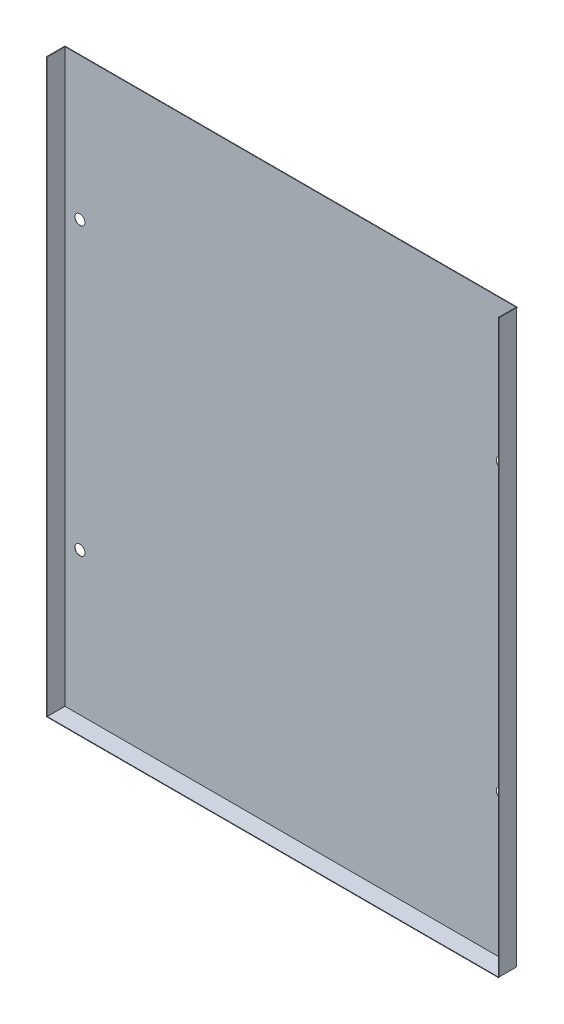
ISO-10303-21;
HEADER;
FILE_DESCRIPTION(('STEP AP214'),'2;1');
FILE_NAME('part.step','',(''),(''),'','','');
FILE_SCHEMA(('AUTOMOTIVE_DESIGN { 1 0 10303 214 1 1 1 1 }'));
ENDSEC;
DATA;
#1=APPLICATION_CONTEXT('core data for automotive mechanical design processes');
#2=APPLICATION_PROTOCOL_DEFINITION('international standard','automotive_design',2000,#1);
#3=PRODUCT_CONTEXT('',#1,'mechanical');
#4=PRODUCT('Part','Part','',(#3));
#5=PRODUCT_RELATED_PRODUCT_CATEGORY('part','',(#4));
#6=PRODUCT_DEFINITION_FORMATION('','',#4);
#7=PRODUCT_DEFINITION_CONTEXT('part definition',#1,'design');
#8=PRODUCT_DEFINITION('design','',#6,#7);
#9=PRODUCT_DEFINITION_SHAPE('','',#8);
#10=(LENGTH_UNIT() NAMED_UNIT(*) SI_UNIT(.MILLI.,.METRE.));
#11=(NAMED_UNIT(*) PLANE_ANGLE_UNIT() SI_UNIT($,.RADIAN.));
#12=(NAMED_UNIT(*) SI_UNIT($,.STERADIAN.) SOLID_ANGLE_UNIT());
#13=UNCERTAINTY_MEASURE_WITH_UNIT(LENGTH_MEASURE(1.E-05),#10,'distance_accuracy_value','');
#14=(GEOMETRIC_REPRESENTATION_CONTEXT(3) GLOBAL_UNCERTAINTY_ASSIGNED_CONTEXT((#13)) GLOBAL_UNIT_ASSIGNED_CONTEXT((#10,
#11,#12)) REPRESENTATION_CONTEXT('',''));
#15=CARTESIAN_POINT('',(0.,0.,0.));
#16=DIRECTION('',(0.,0.,1.));
#17=DIRECTION('',(1.,0.,0.));
#18=AXIS2_PLACEMENT_3D('',#15,#16,#17);
#19=CARTESIAN_POINT('',(-83.71996294,56.94427919,0.0686));
#20=DIRECTION('',(0.,0.,-1.));
#21=DIRECTION('',(-1.,0.,0.));
#22=AXIS2_PLACEMENT_3D('',#19,#20,#21);
#23=CYLINDRICAL_SURFACE('',#22,2.);
#24=CARTESIAN_POINT('',(-83.71996294,56.94427919,0.0686));
#25=DIRECTION('',(0.,0.,1.));
#26=DIRECTION('',(1.,0.,0.));
#27=AXIS2_PLACEMENT_3D('',#24,#25,#26);
#28=CIRCLE('',#27,2.);
#29=CARTESIAN_POINT('',(-81.71996294,56.94427919,0.0686));
#30=VERTEX_POINT('',#29);
#31=EDGE_CURVE('E361',#30,#30,#28,.T.);
#32=ORIENTED_EDGE('',*,*,#31,.T.);
#33=EDGE_LOOP('',(#32));
#34=FACE_BOUND('',#33,.T.);
#35=CARTESIAN_POINT('',(-83.71996294,56.94427919,0.));
#36=DIRECTION('',(0.,0.,1.));
#37=DIRECTION('',(1.,0.,0.));
#38=AXIS2_PLACEMENT_3D('',#35,#36,#37);
#39=CIRCLE('',#38,2.);
#40=CARTESIAN_POINT('',(-81.71996294,56.94427919,0.));
#41=VERTEX_POINT('',#40);
#42=EDGE_CURVE('E366',#41,#41,#39,.T.);
#43=ORIENTED_EDGE('',*,*,#42,.F.);
#44=EDGE_LOOP('',(#43));
#45=FACE_BOUND('',#44,.T.);
#46=ADVANCED_FACE('F37',(#34,#45),#23,.F.);
#47=CARTESIAN_POINT('',(-83.71996294,-56.7081132,0.0686));
#48=DIRECTION('',(0.,0.,-1.));
#49=DIRECTION('',(-1.,0.,0.));
#50=AXIS2_PLACEMENT_3D('',#47,#48,#49);
#51=CYLINDRICAL_SURFACE('',#50,2.);
#52=CARTESIAN_POINT('',(-83.71996294,-56.7081132,0.0686));
#53=DIRECTION('',(0.,0.,1.));
#54=DIRECTION('',(1.,0.,0.));
#55=AXIS2_PLACEMENT_3D('',#52,#53,#54);
#56=CIRCLE('',#55,2.);
#57=CARTESIAN_POINT('',(-81.71996294,-56.7081132,0.0686));
#58=VERTEX_POINT('',#57);
#59=EDGE_CURVE('E358',#58,#58,#56,.T.);
#60=ORIENTED_EDGE('',*,*,#59,.T.);
#61=EDGE_LOOP('',(#60));
#62=FACE_BOUND('',#61,.T.);
#63=CARTESIAN_POINT('',(-83.71996294,-56.7081132,0.));
#64=DIRECTION('',(0.,0.,1.));
#65=DIRECTION('',(1.,0.,0.));
#66=AXIS2_PLACEMENT_3D('',#63,#64,#65);
#67=CIRCLE('',#66,2.);
#68=CARTESIAN_POINT('',(-81.71996294,-56.7081132,0.));
#69=VERTEX_POINT('',#68);
#70=EDGE_CURVE('E264',#69,#69,#67,.T.);
#71=ORIENTED_EDGE('',*,*,#70,.F.);
#72=EDGE_LOOP('',(#71));
#73=FACE_BOUND('',#72,.T.);
#74=ADVANCED_FACE('F39',(#62,#73),#51,.F.);
#75=CARTESIAN_POINT('',(0.,0.,0.0686));
#76=DIRECTION('',(0.,0.,1.));
#77=DIRECTION('',(1.,0.,0.));
#78=AXIS2_PLACEMENT_3D('',#75,#76,#77);
#79=PLANE('',#78);
#80=ORIENTED_EDGE('',*,*,#59,.F.);
#81=EDGE_LOOP('',(#80));
#82=FACE_BOUND('',#81,.T.);
#83=ORIENTED_EDGE('',*,*,#31,.F.);
#84=EDGE_LOOP('',(#83));
#85=FACE_BOUND('',#84,.T.);
#86=DIRECTION('',(0.,1.,0.));
#87=VECTOR('',#86,1.);
#88=CARTESIAN_POINT('',(89.6514,0.,0.0686));
#89=LINE('',#88,#87);
#90=CARTESIAN_POINT('',(89.6514,-113.4657,0.0686000000000003));
#91=VERTEX_POINT('',#90);
#92=CARTESIAN_POINT('',(89.6514,113.5343,0.068600000000002));
#93=VERTEX_POINT('',#92);
#94=EDGE_CURVE('E123',#91,#93,#89,.T.);
#95=ORIENTED_EDGE('',*,*,#94,.T.);
#96=DIRECTION('',(1.,0.,0.));
#97=VECTOR('',#96,1.);
#98=CARTESIAN_POINT('',(-89.6514,113.5343,0.068600000000002));
#99=LINE('',#98,#97);
#100=CARTESIAN_POINT('',(-89.6514,113.5343,0.068600000000002));
#101=VERTEX_POINT('',#100);
#102=EDGE_CURVE('E269',#101,#93,#99,.T.);
#103=ORIENTED_EDGE('',*,*,#102,.F.);
#104=DIRECTION('',(0.,1.,0.));
#105=VECTOR('',#104,1.);
#106=CARTESIAN_POINT('',(-89.6514,0.,0.0686));
#107=LINE('',#106,#105);
#108=CARTESIAN_POINT('',(-89.6514,-113.4657,0.0686000000000003));
#109=VERTEX_POINT('',#108);
#110=EDGE_CURVE('E46',#109,#101,#107,.T.);
#111=ORIENTED_EDGE('',*,*,#110,.F.);
#112=DIRECTION('',(1.,0.,0.));
#113=VECTOR('',#112,1.);
#114=CARTESIAN_POINT('',(0.,-113.4657,0.0686));
#115=LINE('',#114,#113);
#116=EDGE_CURVE('E11',#109,#91,#115,.T.);
#117=ORIENTED_EDGE('',*,*,#116,.T.);
#118=EDGE_LOOP('',(#95,#103,#111,#117));
#119=FACE_BOUND('',#118,.T.);
#120=CARTESIAN_POINT('',(83.71996294,-56.7081132,0.0686));
#121=DIRECTION('',(0.,0.,-1.));
#122=DIRECTION('',(-1.,0.,0.));
#123=AXIS2_PLACEMENT_3D('',#120,#121,#122);
#124=CIRCLE('',#123,2.);
#125=CARTESIAN_POINT('',(81.71996294,-56.7081132,0.0686));
#126=VERTEX_POINT('',#125);
#127=EDGE_CURVE('E154',#126,#126,#124,.T.);
#128=ORIENTED_EDGE('',*,*,#127,.T.);
#129=EDGE_LOOP('',(#128));
#130=FACE_BOUND('',#129,.T.);
#131=CARTESIAN_POINT('',(83.71996294,56.94427919,0.0686));
#132=DIRECTION('',(0.,0.,-1.));
#133=DIRECTION('',(-1.,0.,0.));
#134=AXIS2_PLACEMENT_3D('',#131,#132,#133);
#135=CIRCLE('',#134,2.);
#136=CARTESIAN_POINT('',(81.71996294,56.94427919,0.0686));
#137=VERTEX_POINT('',#136);
#138=EDGE_CURVE('E128',#137,#137,#135,.T.);
#139=ORIENTED_EDGE('',*,*,#138,.T.);
#140=EDGE_LOOP('',(#139));
#141=FACE_BOUND('',#140,.T.);
#142=ADVANCED_FACE('F290',(#82,#85,#119,#130,#141),#79,.T.);
#143=CARTESIAN_POINT('',(0.,0.,0.));
#144=DIRECTION('',(0.,0.,1.));
#145=DIRECTION('',(1.,0.,0.));
#146=AXIS2_PLACEMENT_3D('',#143,#144,#145);
#147=PLANE('',#146);
#148=DIRECTION('',(0.,-1.,0.));
#149=VECTOR('',#148,1.);
#150=CARTESIAN_POINT('',(89.72,113.4657,0.));
#151=LINE('',#150,#149);
#152=CARTESIAN_POINT('',(89.72,113.4657,0.));
#153=VERTEX_POINT('',#152);
#154=CARTESIAN_POINT('',(89.72,-113.5343,0.));
#155=VERTEX_POINT('',#154);
#156=EDGE_CURVE('E170',#153,#155,#151,.T.);
#157=ORIENTED_EDGE('',*,*,#156,.T.);
#158=DIRECTION('',(1.,0.,0.));
#159=VECTOR('',#158,1.);
#160=CARTESIAN_POINT('',(-89.72,-113.5343,0.));
#161=LINE('',#160,#159);
#162=CARTESIAN_POINT('',(-89.72,-113.5343,0.));
#163=VERTEX_POINT('',#162);
#164=EDGE_CURVE('E349',#163,#155,#161,.T.);
#165=ORIENTED_EDGE('',*,*,#164,.F.);
#166=DIRECTION('',(0.,-1.,0.));
#167=VECTOR('',#166,1.);
#168=CARTESIAN_POINT('',(-89.72,113.4657,0.));
#169=LINE('',#168,#167);
#170=CARTESIAN_POINT('',(-89.72,113.4657,0.));
#171=VERTEX_POINT('',#170);
#172=EDGE_CURVE('E351',#171,#163,#169,.T.);
#173=ORIENTED_EDGE('',*,*,#172,.F.);
#174=DIRECTION('',(1.,0.,0.));
#175=VECTOR('',#174,1.);
#176=CARTESIAN_POINT('',(0.,113.4657,0.));
#177=LINE('',#176,#175);
#178=EDGE_CURVE('E73',#171,#153,#177,.T.);
#179=ORIENTED_EDGE('',*,*,#178,.T.);
#180=EDGE_LOOP('',(#157,#165,#173,#179));
#181=FACE_BOUND('',#180,.T.);
#182=ORIENTED_EDGE('',*,*,#70,.T.);
#183=EDGE_LOOP('',(#182));
#184=FACE_BOUND('',#183,.T.);
#185=ORIENTED_EDGE('',*,*,#42,.T.);
#186=EDGE_LOOP('',(#185));
#187=FACE_BOUND('',#186,.T.);
#188=CARTESIAN_POINT('',(83.71996294,-56.7081132,0.));
#189=DIRECTION('',(0.,0.,-1.));
#190=DIRECTION('',(-1.,0.,0.));
#191=AXIS2_PLACEMENT_3D('',#188,#189,#190);
#192=CIRCLE('',#191,2.);
#193=CARTESIAN_POINT('',(81.71996294,-56.7081132,0.));
#194=VERTEX_POINT('',#193);
#195=EDGE_CURVE('E155',#194,#194,#192,.T.);
#196=ORIENTED_EDGE('',*,*,#195,.F.);
#197=EDGE_LOOP('',(#196));
#198=FACE_BOUND('',#197,.T.);
#199=CARTESIAN_POINT('',(83.71996294,56.94427919,0.));
#200=DIRECTION('',(0.,0.,-1.));
#201=DIRECTION('',(-1.,0.,0.));
#202=AXIS2_PLACEMENT_3D('',#199,#200,#201);
#203=CIRCLE('',#202,2.);
#204=CARTESIAN_POINT('',(81.71996294,56.94427919,0.));
#205=VERTEX_POINT('',#204);
#206=EDGE_CURVE('E151',#205,#205,#203,.T.);
#207=ORIENTED_EDGE('',*,*,#206,.F.);
#208=EDGE_LOOP('',(#207));
#209=FACE_BOUND('',#208,.T.);
#210=ADVANCED_FACE('F295',(#181,#184,#187,#198,#209),#147,.F.);
#211=CARTESIAN_POINT('',(0.,-113.4657,7.0524));
#212=DIRECTION('',(0.,-1.,0.));
#213=DIRECTION('',(0.,0.,-1.));
#214=AXIS2_PLACEMENT_3D('',#211,#212,#213);
#215=PLANE('',#214);
#216=ORIENTED_EDGE('',*,*,#116,.F.);
#217=DIRECTION('',(0.,0.,-1.));
#218=VECTOR('',#217,1.);
#219=CARTESIAN_POINT('',(-89.6514,-113.4657,7.0524));
#220=LINE('',#219,#218);
#221=CARTESIAN_POINT('',(-89.6514,-113.4657,7.121));
#222=VERTEX_POINT('',#221);
#223=EDGE_CURVE('E259',#222,#109,#220,.T.);
#224=ORIENTED_EDGE('',*,*,#223,.F.);
#225=DIRECTION('',(-1.,0.,0.));
#226=VECTOR('',#225,1.);
#227=CARTESIAN_POINT('',(-89.6514,-113.4657,7.121));
#228=LINE('',#227,#226);
#229=CARTESIAN_POINT('',(89.6514,-113.4657,7.121));
#230=VERTEX_POINT('',#229);
#231=EDGE_CURVE('E137',#230,#222,#228,.T.);
#232=ORIENTED_EDGE('',*,*,#231,.F.);
#233=DIRECTION('',(0.,0.,-1.));
#234=VECTOR('',#233,1.);
#235=CARTESIAN_POINT('',(89.6514,-113.4657,7.0524));
#236=LINE('',#235,#234);
#237=EDGE_CURVE('E167',#230,#91,#236,.T.);
#238=ORIENTED_EDGE('',*,*,#237,.T.);
#239=EDGE_LOOP('',(#216,#224,#232,#238));
#240=FACE_BOUND('',#239,.T.);
#241=ADVANCED_FACE('F260',(#240),#215,.F.);
#242=CARTESIAN_POINT('',(-89.6514,-113.4657,7.0524));
#243=DIRECTION('',(-1.,0.,0.));
#244=DIRECTION('',(0.,0.,1.));
#245=AXIS2_PLACEMENT_3D('',#242,#243,#244);
#246=PLANE('',#245);
#247=ORIENTED_EDGE('',*,*,#110,.T.);
#248=DIRECTION('',(0.,0.,-1.));
#249=VECTOR('',#248,1.);
#250=CARTESIAN_POINT('',(-89.6514,113.5343,7.0524));
#251=LINE('',#250,#249);
#252=CARTESIAN_POINT('',(-89.6514,113.5343,7.121));
#253=VERTEX_POINT('',#252);
#254=EDGE_CURVE('E116',#253,#101,#251,.T.);
#255=ORIENTED_EDGE('',*,*,#254,.F.);
#256=DIRECTION('',(0.,1.,0.));
#257=VECTOR('',#256,1.);
#258=CARTESIAN_POINT('',(-89.6514,113.5343,7.121));
#259=LINE('',#258,#257);
#260=EDGE_CURVE('E125',#222,#253,#259,.T.);
#261=ORIENTED_EDGE('',*,*,#260,.F.);
#262=ORIENTED_EDGE('',*,*,#223,.T.);
#263=EDGE_LOOP('',(#247,#255,#261,#262));
#264=FACE_BOUND('',#263,.T.);
#265=ADVANCED_FACE('F266',(#264),#246,.F.);
#266=CARTESIAN_POINT('',(-89.72,113.4657,7.0524));
#267=DIRECTION('',(1.,0.,0.));
#268=DIRECTION('',(0.,0.,-1.));
#269=AXIS2_PLACEMENT_3D('',#266,#267,#268);
#270=PLANE('',#269);
#271=ORIENTED_EDGE('',*,*,#172,.T.);
#272=DIRECTION('',(0.,0.,-1.));
#273=VECTOR('',#272,1.);
#274=CARTESIAN_POINT('',(-89.72,-113.5343,7.0524));
#275=LINE('',#274,#273);
#276=CARTESIAN_POINT('',(-89.72,-113.5343,7.0524));
#277=VERTEX_POINT('',#276);
#278=EDGE_CURVE('E61',#277,#163,#275,.T.);
#279=ORIENTED_EDGE('',*,*,#278,.F.);
#280=DIRECTION('',(0.,-1.,0.));
#281=VECTOR('',#280,1.);
#282=CARTESIAN_POINT('',(-89.72,113.4657,7.0524));
#283=LINE('',#282,#281);
#284=CARTESIAN_POINT('',(-89.72,113.4657,7.0524));
#285=VERTEX_POINT('',#284);
#286=EDGE_CURVE('E347',#285,#277,#283,.T.);
#287=ORIENTED_EDGE('',*,*,#286,.F.);
#288=DIRECTION('',(0.,0.,-1.));
#289=VECTOR('',#288,1.);
#290=CARTESIAN_POINT('',(-89.72,113.4657,7.0524));
#291=LINE('',#290,#289);
#292=EDGE_CURVE('E77',#285,#171,#291,.T.);
#293=ORIENTED_EDGE('',*,*,#292,.T.);
#294=EDGE_LOOP('',(#271,#279,#287,#293));
#295=FACE_BOUND('',#294,.T.);
#296=ADVANCED_FACE('F306',(#295),#270,.F.);
#297=CARTESIAN_POINT('',(-89.72,-113.5343,7.0524));
#298=DIRECTION('',(0.,1.,0.));
#299=DIRECTION('',(0.,0.,1.));
#300=AXIS2_PLACEMENT_3D('',#297,#298,#299);
#301=PLANE('',#300);
#302=ORIENTED_EDGE('',*,*,#164,.T.);
#303=DIRECTION('',(0.,0.,-1.));
#304=VECTOR('',#303,1.);
#305=CARTESIAN_POINT('',(89.72,-113.5343,7.0524));
#306=LINE('',#305,#304);
#307=CARTESIAN_POINT('',(89.72,-113.5343,7.0524));
#308=VERTEX_POINT('',#307);
#309=EDGE_CURVE('E157',#308,#155,#306,.T.);
#310=ORIENTED_EDGE('',*,*,#309,.F.);
#311=DIRECTION('',(1.,0.,0.));
#312=VECTOR('',#311,1.);
#313=CARTESIAN_POINT('',(-89.72,-113.5343,7.0524));
#314=LINE('',#313,#312);
#315=EDGE_CURVE('E346',#277,#308,#314,.T.);
#316=ORIENTED_EDGE('',*,*,#315,.F.);
#317=ORIENTED_EDGE('',*,*,#278,.T.);
#318=EDGE_LOOP('',(#302,#310,#316,#317));
#319=FACE_BOUND('',#318,.T.);
#320=ADVANCED_FACE('F309',(#319),#301,.F.);
#321=CARTESIAN_POINT('',(0.,113.4657,0.));
#322=DIRECTION('',(0.,-1.,0.));
#323=DIRECTION('',(0.,0.,-1.));
#324=AXIS2_PLACEMENT_3D('',#321,#322,#323);
#325=PLANE('',#324);
#326=ORIENTED_EDGE('',*,*,#178,.F.);
#327=ORIENTED_EDGE('',*,*,#292,.F.);
#328=DIRECTION('',(1.,0.,0.));
#329=VECTOR('',#328,1.);
#330=CARTESIAN_POINT('',(-89.8724,113.4657,7.0524));
#331=LINE('',#330,#329);
#332=CARTESIAN_POINT('',(-89.8724,113.4657,7.0524));
#333=VERTEX_POINT('',#332);
#334=EDGE_CURVE('E110',#333,#285,#331,.T.);
#335=ORIENTED_EDGE('',*,*,#334,.F.);
#336=DIRECTION('',(0.,0.,1.));
#337=VECTOR('',#336,1.);
#338=CARTESIAN_POINT('',(-89.8724,113.4657,7.0524));
#339=LINE('',#338,#337);
#340=CARTESIAN_POINT('',(-89.8724,113.4657,-0.1524));
#341=VERTEX_POINT('',#340);
#342=EDGE_CURVE('E100',#341,#333,#339,.T.);
#343=ORIENTED_EDGE('',*,*,#342,.F.);
#344=DIRECTION('',(-1.,0.,0.));
#345=VECTOR('',#344,1.);
#346=CARTESIAN_POINT('',(-89.8724,113.4657,-0.1524));
#347=LINE('',#346,#345);
#348=CARTESIAN_POINT('',(89.8724,113.4657,-0.1524));
#349=VERTEX_POINT('',#348);
#350=EDGE_CURVE('E111',#349,#341,#347,.T.);
#351=ORIENTED_EDGE('',*,*,#350,.F.);
#352=DIRECTION('',(0.,0.,1.));
#353=VECTOR('',#352,1.);
#354=CARTESIAN_POINT('',(89.8724,113.4657,7.0524));
#355=LINE('',#354,#353);
#356=CARTESIAN_POINT('',(89.8724,113.4657,7.0524));
#357=VERTEX_POINT('',#356);
#358=EDGE_CURVE('E179',#349,#357,#355,.T.);
#359=ORIENTED_EDGE('',*,*,#358,.T.);
#360=DIRECTION('',(-1.,0.,0.));
#361=VECTOR('',#360,1.);
#362=CARTESIAN_POINT('',(89.8724,113.4657,7.0524));
#363=LINE('',#362,#361);
#364=CARTESIAN_POINT('',(89.72,113.4657,7.0524));
#365=VERTEX_POINT('',#364);
#366=EDGE_CURVE('E183',#357,#365,#363,.T.);
#367=ORIENTED_EDGE('',*,*,#366,.T.);
#368=DIRECTION('',(0.,0.,-1.));
#369=VECTOR('',#368,1.);
#370=CARTESIAN_POINT('',(89.72,113.4657,7.0524));
#371=LINE('',#370,#369);
#372=EDGE_CURVE('E165',#365,#153,#371,.T.);
#373=ORIENTED_EDGE('',*,*,#372,.T.);
#374=EDGE_LOOP('',(#326,#327,#335,#343,#351,#359,#367,#373));
#375=FACE_BOUND('',#374,.T.);
#376=ADVANCED_FACE('F113',(#375),#325,.T.);
#377=CARTESIAN_POINT('',(-89.8724,113.5343,-0.1524));
#378=DIRECTION('',(0.,0.,1.));
#379=DIRECTION('',(1.,0.,0.));
#380=AXIS2_PLACEMENT_3D('',#377,#378,#379);
#381=PLANE('',#380);
#382=ORIENTED_EDGE('',*,*,#350,.T.);
#383=DIRECTION('',(0.,-1.,0.));
#384=VECTOR('',#383,1.);
#385=CARTESIAN_POINT('',(-89.8724,113.5343,-0.1524));
#386=LINE('',#385,#384);
#387=CARTESIAN_POINT('',(-89.8724,113.5343,-0.1524));
#388=VERTEX_POINT('',#387);
#389=EDGE_CURVE('E108',#388,#341,#386,.T.);
#390=ORIENTED_EDGE('',*,*,#389,.F.);
#391=DIRECTION('',(-1.,0.,0.));
#392=VECTOR('',#391,1.);
#393=CARTESIAN_POINT('',(-89.8724,113.5343,-0.1524));
#394=LINE('',#393,#392);
#395=CARTESIAN_POINT('',(89.8724,113.5343,-0.1524));
#396=VERTEX_POINT('',#395);
#397=EDGE_CURVE('E85',#396,#388,#394,.T.);
#398=ORIENTED_EDGE('',*,*,#397,.F.);
#399=DIRECTION('',(0.,-1.,0.));
#400=VECTOR('',#399,1.);
#401=CARTESIAN_POINT('',(89.8724,113.5343,-0.1524));
#402=LINE('',#401,#400);
#403=EDGE_CURVE('E173',#396,#349,#402,.T.);
#404=ORIENTED_EDGE('',*,*,#403,.T.);
#405=EDGE_LOOP('',(#382,#390,#398,#404));
#406=FACE_BOUND('',#405,.T.);
#407=ADVANCED_FACE('F313',(#406),#381,.F.);
#408=CARTESIAN_POINT('',(-89.8724,113.5343,7.0524));
#409=DIRECTION('',(1.,0.,0.));
#410=DIRECTION('',(0.,0.,-1.));
#411=AXIS2_PLACEMENT_3D('',#408,#409,#410);
#412=PLANE('',#411);
#413=ORIENTED_EDGE('',*,*,#342,.T.);
#414=DIRECTION('',(0.,-1.,0.));
#415=VECTOR('',#414,1.);
#416=CARTESIAN_POINT('',(-89.8724,-113.6867,7.0524));
#417=LINE('',#416,#415);
#418=CARTESIAN_POINT('',(-89.8724,-113.6867,7.0524));
#419=VERTEX_POINT('',#418);
#420=EDGE_CURVE('E105',#333,#419,#417,.T.);
#421=ORIENTED_EDGE('',*,*,#420,.T.);
#422=DIRECTION('',(0.,0.,-1.));
#423=VECTOR('',#422,1.);
#424=CARTESIAN_POINT('',(-89.8724,-113.6867,7.121));
#425=LINE('',#424,#423);
#426=CARTESIAN_POINT('',(-89.8724,-113.6867,7.121));
#427=VERTEX_POINT('',#426);
#428=EDGE_CURVE('E133',#427,#419,#425,.T.);
#429=ORIENTED_EDGE('',*,*,#428,.F.);
#430=DIRECTION('',(0.,-1.,0.));
#431=VECTOR('',#430,1.);
#432=CARTESIAN_POINT('',(-89.8724,-113.6867,7.121));
#433=LINE('',#432,#431);
#434=CARTESIAN_POINT('',(-89.8724,113.5343,7.121));
#435=VERTEX_POINT('',#434);
#436=EDGE_CURVE('E143',#435,#427,#433,.T.);
#437=ORIENTED_EDGE('',*,*,#436,.F.);
#438=DIRECTION('',(0.,0.,1.));
#439=VECTOR('',#438,1.);
#440=CARTESIAN_POINT('',(-89.8724,113.5343,7.0524));
#441=LINE('',#440,#439);
#442=EDGE_CURVE('E270',#388,#435,#441,.T.);
#443=ORIENTED_EDGE('',*,*,#442,.F.);
#444=ORIENTED_EDGE('',*,*,#389,.T.);
#445=EDGE_LOOP('',(#413,#421,#429,#437,#443,#444));
#446=FACE_BOUND('',#445,.T.);
#447=ADVANCED_FACE('F101',(#446),#412,.F.);
#448=CARTESIAN_POINT('',(0.,113.5343,0.));
#449=DIRECTION('',(0.,-1.,0.));
#450=DIRECTION('',(0.,0.,-1.));
#451=AXIS2_PLACEMENT_3D('',#448,#449,#450);
#452=PLANE('',#451);
#453=ORIENTED_EDGE('',*,*,#254,.T.);
#454=ORIENTED_EDGE('',*,*,#102,.T.);
#455=DIRECTION('',(0.,0.,-1.));
#456=VECTOR('',#455,1.);
#457=CARTESIAN_POINT('',(89.6514,113.5343,7.0524));
#458=LINE('',#457,#456);
#459=CARTESIAN_POINT('',(89.6514,113.5343,7.121));
#460=VERTEX_POINT('',#459);
#461=EDGE_CURVE('E182',#460,#93,#458,.T.);
#462=ORIENTED_EDGE('',*,*,#461,.F.);
#463=DIRECTION('',(1.,0.,0.));
#464=VECTOR('',#463,1.);
#465=CARTESIAN_POINT('',(89.8724,113.5343,7.121));
#466=LINE('',#465,#464);
#467=CARTESIAN_POINT('',(89.8724,113.5343,7.121));
#468=VERTEX_POINT('',#467);
#469=EDGE_CURVE('E193',#460,#468,#466,.T.);
#470=ORIENTED_EDGE('',*,*,#469,.T.);
#471=DIRECTION('',(0.,0.,1.));
#472=VECTOR('',#471,1.);
#473=CARTESIAN_POINT('',(89.8724,113.5343,7.0524));
#474=LINE('',#473,#472);
#475=EDGE_CURVE('E178',#396,#468,#474,.T.);
#476=ORIENTED_EDGE('',*,*,#475,.F.);
#477=ORIENTED_EDGE('',*,*,#397,.T.);
#478=ORIENTED_EDGE('',*,*,#442,.T.);
#479=DIRECTION('',(-1.,0.,0.));
#480=VECTOR('',#479,1.);
#481=CARTESIAN_POINT('',(-89.8724,113.5343,7.121));
#482=LINE('',#481,#480);
#483=EDGE_CURVE('E146',#253,#435,#482,.T.);
#484=ORIENTED_EDGE('',*,*,#483,.F.);
#485=EDGE_LOOP('',(#453,#454,#462,#470,#476,#477,#478,#484));
#486=FACE_BOUND('',#485,.T.);
#487=ADVANCED_FACE('F220',(#486),#452,.F.);
#488=CARTESIAN_POINT('',(0.,0.,7.0524));
#489=DIRECTION('',(0.,0.,1.));
#490=DIRECTION('',(1.,0.,0.));
#491=AXIS2_PLACEMENT_3D('',#488,#489,#490);
#492=PLANE('',#491);
#493=ORIENTED_EDGE('',*,*,#420,.F.);
#494=ORIENTED_EDGE('',*,*,#334,.T.);
#495=ORIENTED_EDGE('',*,*,#286,.T.);
#496=ORIENTED_EDGE('',*,*,#315,.T.);
#497=DIRECTION('',(0.,-1.,0.));
#498=VECTOR('',#497,1.);
#499=CARTESIAN_POINT('',(89.72,113.4657,7.0524));
#500=LINE('',#499,#498);
#501=EDGE_CURVE('E169',#365,#308,#500,.T.);
#502=ORIENTED_EDGE('',*,*,#501,.F.);
#503=ORIENTED_EDGE('',*,*,#366,.F.);
#504=DIRECTION('',(0.,-1.,0.));
#505=VECTOR('',#504,1.);
#506=CARTESIAN_POINT('',(89.8724,-113.6867,7.0524));
#507=LINE('',#506,#505);
#508=CARTESIAN_POINT('',(89.8724,-113.6867,7.0524));
#509=VERTEX_POINT('',#508);
#510=EDGE_CURVE('E194',#357,#509,#507,.T.);
#511=ORIENTED_EDGE('',*,*,#510,.T.);
#512=DIRECTION('',(1.,0.,0.));
#513=VECTOR('',#512,1.);
#514=CARTESIAN_POINT('',(0.,-113.6867,7.0524));
#515=LINE('',#514,#513);
#516=EDGE_CURVE('E122',#419,#509,#515,.T.);
#517=ORIENTED_EDGE('',*,*,#516,.F.);
#518=EDGE_LOOP('',(#493,#494,#495,#496,#502,#503,#511,#517));
#519=FACE_BOUND('',#518,.T.);
#520=ADVANCED_FACE('F119',(#519),#492,.F.);
#521=CARTESIAN_POINT('',(0.,-113.6867,7.121));
#522=DIRECTION('',(0.,1.,0.));
#523=DIRECTION('',(0.,0.,1.));
#524=AXIS2_PLACEMENT_3D('',#521,#522,#523);
#525=PLANE('',#524);
#526=ORIENTED_EDGE('',*,*,#516,.T.);
#527=DIRECTION('',(0.,0.,-1.));
#528=VECTOR('',#527,1.);
#529=CARTESIAN_POINT('',(89.8724,-113.6867,7.121));
#530=LINE('',#529,#528);
#531=CARTESIAN_POINT('',(89.8724,-113.6867,7.121));
#532=VERTEX_POINT('',#531);
#533=EDGE_CURVE('E186',#532,#509,#530,.T.);
#534=ORIENTED_EDGE('',*,*,#533,.F.);
#535=DIRECTION('',(1.,0.,0.));
#536=VECTOR('',#535,1.);
#537=CARTESIAN_POINT('',(0.,-113.6867,7.121));
#538=LINE('',#537,#536);
#539=EDGE_CURVE('E140',#427,#532,#538,.T.);
#540=ORIENTED_EDGE('',*,*,#539,.F.);
#541=ORIENTED_EDGE('',*,*,#428,.T.);
#542=EDGE_LOOP('',(#526,#534,#540,#541));
#543=FACE_BOUND('',#542,.T.);
#544=ADVANCED_FACE('F275',(#543),#525,.F.);
#545=CARTESIAN_POINT('',(0.,0.,7.121));
#546=DIRECTION('',(0.,0.,1.));
#547=DIRECTION('',(1.,0.,0.));
#548=AXIS2_PLACEMENT_3D('',#545,#546,#547);
#549=PLANE('',#548);
#550=ORIENTED_EDGE('',*,*,#260,.T.);
#551=ORIENTED_EDGE('',*,*,#483,.T.);
#552=ORIENTED_EDGE('',*,*,#436,.T.);
#553=ORIENTED_EDGE('',*,*,#539,.T.);
#554=DIRECTION('',(0.,-1.,0.));
#555=VECTOR('',#554,1.);
#556=CARTESIAN_POINT('',(89.8724,-113.6867,7.121));
#557=LINE('',#556,#555);
#558=EDGE_CURVE('E199',#468,#532,#557,.T.);
#559=ORIENTED_EDGE('',*,*,#558,.F.);
#560=ORIENTED_EDGE('',*,*,#469,.F.);
#561=DIRECTION('',(0.,1.,0.));
#562=VECTOR('',#561,1.);
#563=CARTESIAN_POINT('',(89.6514,113.5343,7.121));
#564=LINE('',#563,#562);
#565=EDGE_CURVE('E196',#230,#460,#564,.T.);
#566=ORIENTED_EDGE('',*,*,#565,.F.);
#567=ORIENTED_EDGE('',*,*,#231,.T.);
#568=EDGE_LOOP('',(#550,#551,#552,#553,#559,#560,#566,#567));
#569=FACE_BOUND('',#568,.T.);
#570=ADVANCED_FACE('F218',(#569),#549,.T.);
#571=CARTESIAN_POINT('',(83.71996294,56.94427919,0.0686));
#572=DIRECTION('',(0.,0.,-1.));
#573=DIRECTION('',(-1.,0.,0.));
#574=AXIS2_PLACEMENT_3D('',#571,#572,#573);
#575=CYLINDRICAL_SURFACE('',#574,2.);
#576=ORIENTED_EDGE('',*,*,#138,.F.);
#577=EDGE_LOOP('',(#576));
#578=FACE_BOUND('',#577,.T.);
#579=ORIENTED_EDGE('',*,*,#206,.T.);
#580=EDGE_LOOP('',(#579));
#581=FACE_BOUND('',#580,.T.);
#582=ADVANCED_FACE('F329',(#578,#581),#575,.F.);
#583=CARTESIAN_POINT('',(83.71996294,-56.7081132,0.0686));
#584=DIRECTION('',(0.,0.,-1.));
#585=DIRECTION('',(-1.,0.,0.));
#586=AXIS2_PLACEMENT_3D('',#583,#584,#585);
#587=CYLINDRICAL_SURFACE('',#586,2.);
#588=ORIENTED_EDGE('',*,*,#127,.F.);
#589=EDGE_LOOP('',(#588));
#590=FACE_BOUND('',#589,.T.);
#591=ORIENTED_EDGE('',*,*,#195,.T.);
#592=EDGE_LOOP('',(#591));
#593=FACE_BOUND('',#592,.T.);
#594=ADVANCED_FACE('F330',(#590,#593),#587,.F.);
#595=CARTESIAN_POINT('',(89.72,113.4657,7.0524));
#596=DIRECTION('',(1.,0.,0.));
#597=DIRECTION('',(0.,0.,-1.));
#598=AXIS2_PLACEMENT_3D('',#595,#596,#597);
#599=PLANE('',#598);
#600=ORIENTED_EDGE('',*,*,#156,.F.);
#601=ORIENTED_EDGE('',*,*,#372,.F.);
#602=ORIENTED_EDGE('',*,*,#501,.T.);
#603=ORIENTED_EDGE('',*,*,#309,.T.);
#604=EDGE_LOOP('',(#600,#601,#602,#603));
#605=FACE_BOUND('',#604,.T.);
#606=ADVANCED_FACE('F283',(#605),#599,.T.);
#607=CARTESIAN_POINT('',(89.6514,-113.4657,7.0524));
#608=DIRECTION('',(-1.,0.,0.));
#609=DIRECTION('',(0.,0.,1.));
#610=AXIS2_PLACEMENT_3D('',#607,#608,#609);
#611=PLANE('',#610);
#612=ORIENTED_EDGE('',*,*,#237,.F.);
#613=ORIENTED_EDGE('',*,*,#565,.T.);
#614=ORIENTED_EDGE('',*,*,#461,.T.);
#615=ORIENTED_EDGE('',*,*,#94,.F.);
#616=EDGE_LOOP('',(#612,#613,#614,#615));
#617=FACE_BOUND('',#616,.T.);
#618=ADVANCED_FACE('F208',(#617),#611,.T.);
#619=CARTESIAN_POINT('',(89.8724,113.5343,7.0524));
#620=DIRECTION('',(1.,0.,0.));
#621=DIRECTION('',(0.,0.,-1.));
#622=AXIS2_PLACEMENT_3D('',#619,#620,#621);
#623=PLANE('',#622);
#624=ORIENTED_EDGE('',*,*,#358,.F.);
#625=ORIENTED_EDGE('',*,*,#403,.F.);
#626=ORIENTED_EDGE('',*,*,#475,.T.);
#627=ORIENTED_EDGE('',*,*,#558,.T.);
#628=ORIENTED_EDGE('',*,*,#533,.T.);
#629=ORIENTED_EDGE('',*,*,#510,.F.);
#630=EDGE_LOOP('',(#624,#625,#626,#627,#628,#629));
#631=FACE_BOUND('',#630,.T.);
#632=ADVANCED_FACE('F277',(#631),#623,.T.);
#633=CLOSED_SHELL('',(#46,#74,#142,#210,#241,#265,#296,#320,#376,#407,#447,#487,#520,#544,#570,
#582,#594,#606,#618,#632));
#634=MANIFOLD_SOLID_BREP('B2',#633);
#635=ADVANCED_BREP_SHAPE_REPRESENTATION('',(#18,#634),#14);
#636=SHAPE_DEFINITION_REPRESENTATION(#9,#635);
ENDSEC;
END-ISO-10303-21;
